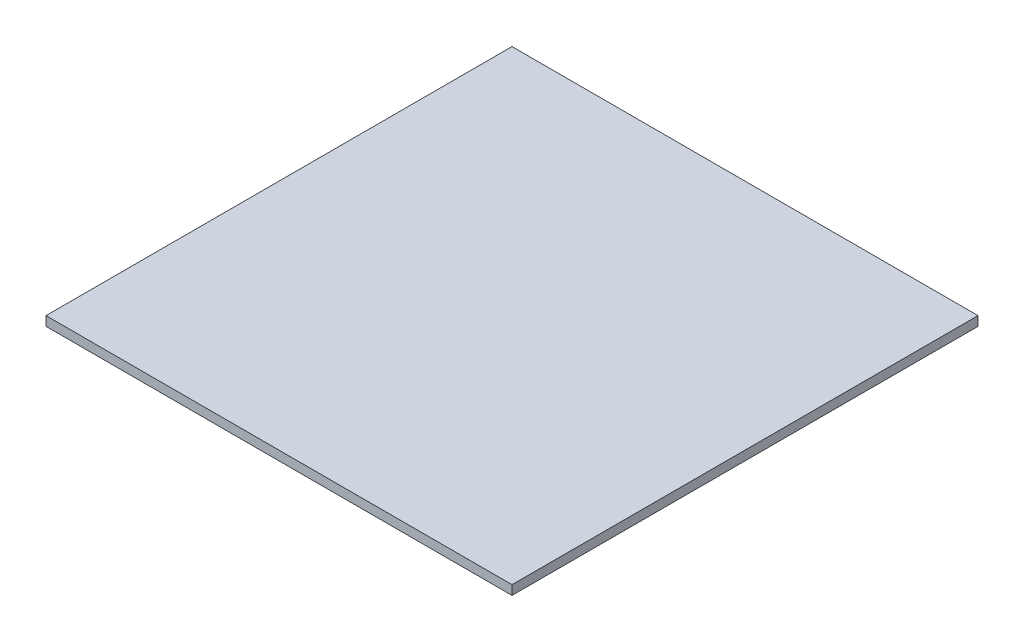
ISO-10303-21;
HEADER;
FILE_DESCRIPTION(('STEP AP214'),'2;1');
FILE_NAME('part.step','',(''),(''),'','','');
FILE_SCHEMA(('AUTOMOTIVE_DESIGN { 1 0 10303 214 1 1 1 1 }'));
ENDSEC;
DATA;
#1=APPLICATION_CONTEXT('core data for automotive mechanical design processes');
#2=APPLICATION_PROTOCOL_DEFINITION('international standard','automotive_design',2000,#1);
#3=PRODUCT_CONTEXT('',#1,'mechanical');
#4=PRODUCT('Part','Part','',(#3));
#5=PRODUCT_RELATED_PRODUCT_CATEGORY('part','',(#4));
#6=PRODUCT_DEFINITION_FORMATION('','',#4);
#7=PRODUCT_DEFINITION_CONTEXT('part definition',#1,'design');
#8=PRODUCT_DEFINITION('design','',#6,#7);
#9=PRODUCT_DEFINITION_SHAPE('','',#8);
#10=(LENGTH_UNIT() NAMED_UNIT(*) SI_UNIT(.MILLI.,.METRE.));
#11=(NAMED_UNIT(*) PLANE_ANGLE_UNIT() SI_UNIT($,.RADIAN.));
#12=(NAMED_UNIT(*) SI_UNIT($,.STERADIAN.) SOLID_ANGLE_UNIT());
#13=UNCERTAINTY_MEASURE_WITH_UNIT(LENGTH_MEASURE(1.E-05),#10,'distance_accuracy_value','');
#14=(GEOMETRIC_REPRESENTATION_CONTEXT(3) GLOBAL_UNCERTAINTY_ASSIGNED_CONTEXT((#13)) GLOBAL_UNIT_ASSIGNED_CONTEXT((#10,
#11,#12)) REPRESENTATION_CONTEXT('',''));
#15=CARTESIAN_POINT('',(0.,0.,0.));
#16=DIRECTION('',(0.,0.,1.));
#17=DIRECTION('',(1.,0.,0.));
#18=AXIS2_PLACEMENT_3D('',#15,#16,#17);
#19=CARTESIAN_POINT('',(11.3706139276414,3.,19.2692941102811));
#20=DIRECTION('',(1.,0.,0.));
#21=DIRECTION('',(0.,0.,-1.));
#22=AXIS2_PLACEMENT_3D('',#19,#20,#21);
#23=PLANE('',#22);
#24=DIRECTION('',(0.,0.,1.));
#25=VECTOR('',#24,1.);
#26=CARTESIAN_POINT('',(11.3706139276414,0.,19.2692941102811));
#27=LINE('',#26,#25);
#28=CARTESIAN_POINT('',(11.3706139276414,0.,-130.730705889719));
#29=VERTEX_POINT('',#28);
#30=CARTESIAN_POINT('',(11.3706139276414,0.,19.2692941102811));
#31=VERTEX_POINT('',#30);
#32=EDGE_CURVE('E96',#29,#31,#27,.T.);
#33=ORIENTED_EDGE('',*,*,#32,.T.);
#34=DIRECTION('',(0.,-1.,0.));
#35=VECTOR('',#34,1.);
#36=CARTESIAN_POINT('',(11.3706139276414,3.,19.2692941102811));
#37=LINE('',#36,#35);
#38=CARTESIAN_POINT('',(11.3706139276414,3.,19.2692941102811));
#39=VERTEX_POINT('',#38);
#40=EDGE_CURVE('E11',#39,#31,#37,.T.);
#41=ORIENTED_EDGE('',*,*,#40,.F.);
#42=DIRECTION('',(0.,0.,1.));
#43=VECTOR('',#42,1.);
#44=CARTESIAN_POINT('',(11.3706139276414,3.,19.2692941102811));
#45=LINE('',#44,#43);
#46=CARTESIAN_POINT('',(11.3706139276414,3.,-130.730705889719));
#47=VERTEX_POINT('',#46);
#48=EDGE_CURVE('E84',#47,#39,#45,.T.);
#49=ORIENTED_EDGE('',*,*,#48,.F.);
#50=DIRECTION('',(0.,-1.,0.));
#51=VECTOR('',#50,1.);
#52=CARTESIAN_POINT('',(11.3706139276414,3.,-130.730705889719));
#53=LINE('',#52,#51);
#54=EDGE_CURVE('E92',#47,#29,#53,.T.);
#55=ORIENTED_EDGE('',*,*,#54,.T.);
#56=EDGE_LOOP('',(#33,#41,#49,#55));
#57=FACE_BOUND('',#56,.T.);
#58=ADVANCED_FACE('F33',(#57),#23,.F.);
#59=CARTESIAN_POINT('',(11.3706139276414,3.,19.2692941102811));
#60=DIRECTION('',(0.,0.,-1.));
#61=DIRECTION('',(-1.,0.,0.));
#62=AXIS2_PLACEMENT_3D('',#59,#60,#61);
#63=PLANE('',#62);
#64=DIRECTION('',(1.,0.,0.));
#65=VECTOR('',#64,1.);
#66=CARTESIAN_POINT('',(11.3706139276414,0.,19.2692941102811));
#67=LINE('',#66,#65);
#68=CARTESIAN_POINT('',(161.370613927641,0.,19.2692941102811));
#69=VERTEX_POINT('',#68);
#70=EDGE_CURVE('E88',#31,#69,#67,.T.);
#71=ORIENTED_EDGE('',*,*,#70,.T.);
#72=DIRECTION('',(0.,-1.,0.));
#73=VECTOR('',#72,1.);
#74=CARTESIAN_POINT('',(161.370613927641,3.,19.2692941102811));
#75=LINE('',#74,#73);
#76=CARTESIAN_POINT('',(161.370613927641,3.,19.2692941102811));
#77=VERTEX_POINT('',#76);
#78=EDGE_CURVE('E41',#77,#69,#75,.T.);
#79=ORIENTED_EDGE('',*,*,#78,.F.);
#80=DIRECTION('',(1.,0.,0.));
#81=VECTOR('',#80,1.);
#82=CARTESIAN_POINT('',(11.3706139276414,3.,19.2692941102811));
#83=LINE('',#82,#81);
#84=EDGE_CURVE('E79',#39,#77,#83,.T.);
#85=ORIENTED_EDGE('',*,*,#84,.F.);
#86=ORIENTED_EDGE('',*,*,#40,.T.);
#87=EDGE_LOOP('',(#71,#79,#85,#86));
#88=FACE_BOUND('',#87,.T.);
#89=ADVANCED_FACE('F87',(#88),#63,.F.);
#90=CARTESIAN_POINT('',(161.370613927641,3.,19.2692941102811));
#91=DIRECTION('',(-1.,0.,0.));
#92=DIRECTION('',(0.,0.,1.));
#93=AXIS2_PLACEMENT_3D('',#90,#91,#92);
#94=PLANE('',#93);
#95=DIRECTION('',(0.,0.,-1.));
#96=VECTOR('',#95,1.);
#97=CARTESIAN_POINT('',(161.370613927641,0.,19.2692941102811));
#98=LINE('',#97,#96);
#99=CARTESIAN_POINT('',(161.370613927641,0.,-130.730705889719));
#100=VERTEX_POINT('',#99);
#101=EDGE_CURVE('E66',#69,#100,#98,.T.);
#102=ORIENTED_EDGE('',*,*,#101,.T.);
#103=DIRECTION('',(0.,-1.,0.));
#104=VECTOR('',#103,1.);
#105=CARTESIAN_POINT('',(161.370613927641,3.,-130.730705889719));
#106=LINE('',#105,#104);
#107=CARTESIAN_POINT('',(161.370613927641,3.,-130.730705889719));
#108=VERTEX_POINT('',#107);
#109=EDGE_CURVE('E89',#108,#100,#106,.T.);
#110=ORIENTED_EDGE('',*,*,#109,.F.);
#111=DIRECTION('',(0.,0.,-1.));
#112=VECTOR('',#111,1.);
#113=CARTESIAN_POINT('',(161.370613927641,3.,19.2692941102811));
#114=LINE('',#113,#112);
#115=EDGE_CURVE('E82',#77,#108,#114,.T.);
#116=ORIENTED_EDGE('',*,*,#115,.F.);
#117=ORIENTED_EDGE('',*,*,#78,.T.);
#118=EDGE_LOOP('',(#102,#110,#116,#117));
#119=FACE_BOUND('',#118,.T.);
#120=ADVANCED_FACE('F90',(#119),#94,.F.);
#121=CARTESIAN_POINT('',(11.3706139276414,3.,-130.730705889719));
#122=DIRECTION('',(0.,0.,1.));
#123=DIRECTION('',(1.,0.,0.));
#124=AXIS2_PLACEMENT_3D('',#121,#122,#123);
#125=PLANE('',#124);
#126=DIRECTION('',(-1.,0.,0.));
#127=VECTOR('',#126,1.);
#128=CARTESIAN_POINT('',(11.3706139276414,0.,-130.730705889719));
#129=LINE('',#128,#127);
#130=EDGE_CURVE('E72',#100,#29,#129,.T.);
#131=ORIENTED_EDGE('',*,*,#130,.T.);
#132=ORIENTED_EDGE('',*,*,#54,.F.);
#133=DIRECTION('',(-1.,0.,0.));
#134=VECTOR('',#133,1.);
#135=CARTESIAN_POINT('',(11.3706139276414,3.,-130.730705889719));
#136=LINE('',#135,#134);
#137=EDGE_CURVE('E49',#108,#47,#136,.T.);
#138=ORIENTED_EDGE('',*,*,#137,.F.);
#139=ORIENTED_EDGE('',*,*,#109,.T.);
#140=EDGE_LOOP('',(#131,#132,#138,#139));
#141=FACE_BOUND('',#140,.T.);
#142=ADVANCED_FACE('F103',(#141),#125,.F.);
#143=CARTESIAN_POINT('',(0.,3.,0.));
#144=DIRECTION('',(0.,-1.,0.));
#145=DIRECTION('',(0.,0.,-1.));
#146=AXIS2_PLACEMENT_3D('',#143,#144,#145);
#147=PLANE('',#146);
#148=ORIENTED_EDGE('',*,*,#48,.T.);
#149=ORIENTED_EDGE('',*,*,#84,.T.);
#150=ORIENTED_EDGE('',*,*,#115,.T.);
#151=ORIENTED_EDGE('',*,*,#137,.T.);
#152=EDGE_LOOP('',(#148,#149,#150,#151));
#153=FACE_BOUND('',#152,.T.);
#154=ADVANCED_FACE('F80',(#153),#147,.F.);
#155=CARTESIAN_POINT('',(0.,0.,0.));
#156=DIRECTION('',(0.,-1.,0.));
#157=DIRECTION('',(0.,0.,-1.));
#158=AXIS2_PLACEMENT_3D('',#155,#156,#157);
#159=PLANE('',#158);
#160=ORIENTED_EDGE('',*,*,#32,.F.);
#161=ORIENTED_EDGE('',*,*,#130,.F.);
#162=ORIENTED_EDGE('',*,*,#101,.F.);
#163=ORIENTED_EDGE('',*,*,#70,.F.);
#164=EDGE_LOOP('',(#160,#161,#162,#163));
#165=FACE_BOUND('',#164,.T.);
#166=ADVANCED_FACE('F106',(#165),#159,.T.);
#167=CLOSED_SHELL('',(#58,#89,#120,#142,#154,#166));
#168=MANIFOLD_SOLID_BREP('B2',#167);
#169=ADVANCED_BREP_SHAPE_REPRESENTATION('',(#18,#168),#14);
#170=SHAPE_DEFINITION_REPRESENTATION(#9,#169);
ENDSEC;
END-ISO-10303-21;
